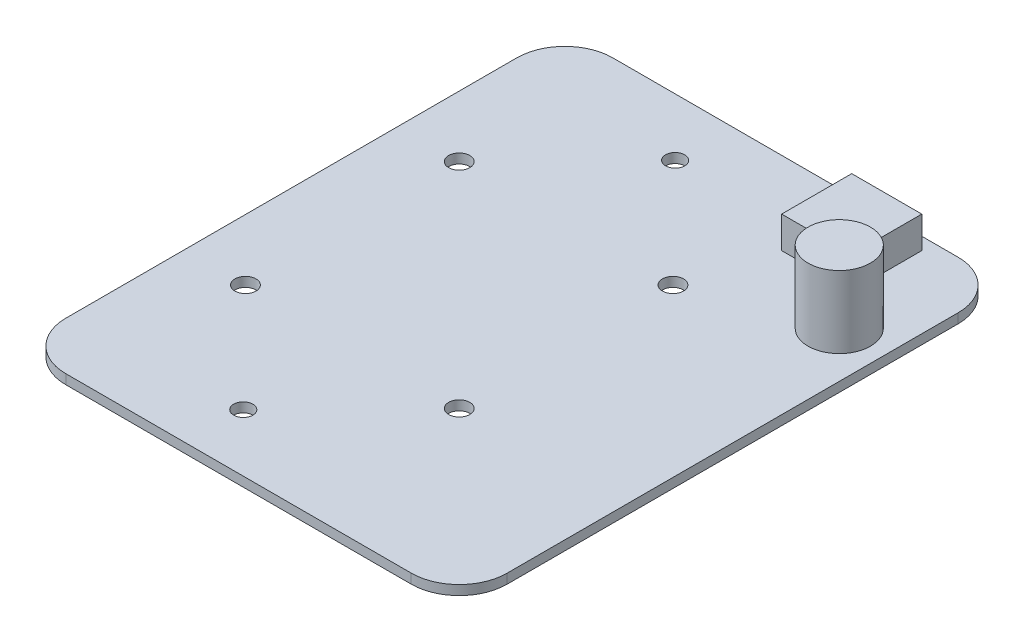
ISO-10303-21;
HEADER;
FILE_DESCRIPTION(('STEP AP214'),'2;1');
FILE_NAME('part.step','',(''),(''),'','','');
FILE_SCHEMA(('AUTOMOTIVE_DESIGN { 1 0 10303 214 1 1 1 1 }'));
ENDSEC;
DATA;
#1=APPLICATION_CONTEXT('core data for automotive mechanical design processes');
#2=APPLICATION_PROTOCOL_DEFINITION('international standard','automotive_design',2000,#1);
#3=PRODUCT_CONTEXT('',#1,'mechanical');
#4=PRODUCT('Part','Part','',(#3));
#5=PRODUCT_RELATED_PRODUCT_CATEGORY('part','',(#4));
#6=PRODUCT_DEFINITION_FORMATION('','',#4);
#7=PRODUCT_DEFINITION_CONTEXT('part definition',#1,'design');
#8=PRODUCT_DEFINITION('design','',#6,#7);
#9=PRODUCT_DEFINITION_SHAPE('','',#8);
#10=(LENGTH_UNIT() NAMED_UNIT(*) SI_UNIT(.MILLI.,.METRE.));
#11=(NAMED_UNIT(*) PLANE_ANGLE_UNIT() SI_UNIT($,.RADIAN.));
#12=(NAMED_UNIT(*) SI_UNIT($,.STERADIAN.) SOLID_ANGLE_UNIT());
#13=UNCERTAINTY_MEASURE_WITH_UNIT(LENGTH_MEASURE(1.E-05),#10,'distance_accuracy_value','');
#14=(GEOMETRIC_REPRESENTATION_CONTEXT(3) GLOBAL_UNCERTAINTY_ASSIGNED_CONTEXT((#13)) GLOBAL_UNIT_ASSIGNED_CONTEXT((#10,
#11,#12)) REPRESENTATION_CONTEXT('',''));
#15=CARTESIAN_POINT('',(0.,0.,0.));
#16=DIRECTION('',(0.,0.,1.));
#17=DIRECTION('',(1.,0.,0.));
#18=AXIS2_PLACEMENT_3D('',#15,#16,#17);
#19=CARTESIAN_POINT('',(-12.5,0.,-23.5));
#20=DIRECTION('',(0.,1.,0.));
#21=DIRECTION('',(0.,0.,1.));
#22=AXIS2_PLACEMENT_3D('',#19,#20,#21);
#23=PLANE('',#22);
#24=CARTESIAN_POINT('',(0.,0.,22.5));
#25=DIRECTION('',(0.,-1.,0.));
#26=DIRECTION('',(0.,0.,-1.));
#27=AXIS2_PLACEMENT_3D('',#24,#25,#26);
#28=CIRCLE('',#27,0.999999999999997);
#29=CARTESIAN_POINT('',(0.,0.,21.5));
#30=VERTEX_POINT('',#29);
#31=EDGE_CURVE('E175',#30,#30,#28,.T.);
#32=ORIENTED_EDGE('',*,*,#31,.F.);
#33=EDGE_LOOP('',(#32));
#34=FACE_BOUND('',#33,.T.);
#35=CARTESIAN_POINT('',(-11.136931804,3.11899811533678E-10,11.136931804));
#36=DIRECTION('',(0.,-1.,0.));
#37=DIRECTION('',(0.,0.,-1.));
#38=AXIS2_PLACEMENT_3D('',#35,#36,#37);
#39=CIRCLE('',#38,1.1);
#40=CARTESIAN_POINT('',(-11.136931804,3.11899811533678E-10,10.036931804));
#41=VERTEX_POINT('',#40);
#42=EDGE_CURVE('E191',#41,#41,#39,.T.);
#43=ORIENTED_EDGE('',*,*,#42,.F.);
#44=EDGE_LOOP('',(#43));
#45=FACE_BOUND('',#44,.T.);
#46=CARTESIAN_POINT('',(0.,0.,-22.5));
#47=DIRECTION('',(0.,-1.,0.));
#48=DIRECTION('',(0.,0.,-1.));
#49=AXIS2_PLACEMENT_3D('',#46,#47,#48);
#50=CIRCLE('',#49,1.);
#51=CARTESIAN_POINT('',(0.,0.,-23.5));
#52=VERTEX_POINT('',#51);
#53=EDGE_CURVE('E179',#52,#52,#50,.T.);
#54=ORIENTED_EDGE('',*,*,#53,.F.);
#55=EDGE_LOOP('',(#54));
#56=FACE_BOUND('',#55,.T.);
#57=CARTESIAN_POINT('',(11.136931804,3.11899811533678E-10,11.136931804));
#58=DIRECTION('',(0.,-1.,0.));
#59=DIRECTION('',(0.,0.,-1.));
#60=AXIS2_PLACEMENT_3D('',#57,#58,#59);
#61=CIRCLE('',#60,1.1);
#62=CARTESIAN_POINT('',(11.136931804,3.11899811533678E-10,10.036931804));
#63=VERTEX_POINT('',#62);
#64=EDGE_CURVE('E188',#63,#63,#61,.T.);
#65=ORIENTED_EDGE('',*,*,#64,.F.);
#66=EDGE_LOOP('',(#65));
#67=FACE_BOUND('',#66,.T.);
#68=CARTESIAN_POINT('',(11.136931804,-3.11899811533678E-10,-11.136931804));
#69=DIRECTION('',(0.,-1.,0.));
#70=DIRECTION('',(0.,0.,-1.));
#71=AXIS2_PLACEMENT_3D('',#68,#69,#70);
#72=CIRCLE('',#71,1.1);
#73=CARTESIAN_POINT('',(11.136931804,-3.11899811533678E-10,-12.236931804));
#74=VERTEX_POINT('',#73);
#75=EDGE_CURVE('E182',#74,#74,#72,.T.);
#76=ORIENTED_EDGE('',*,*,#75,.F.);
#77=EDGE_LOOP('',(#76));
#78=FACE_BOUND('',#77,.T.);
#79=CARTESIAN_POINT('',(-11.136931804,-3.11899811533678E-10,-11.136931804));
#80=DIRECTION('',(0.,-1.,0.));
#81=DIRECTION('',(0.,0.,-1.));
#82=AXIS2_PLACEMENT_3D('',#79,#80,#81);
#83=CIRCLE('',#82,1.1);
#84=CARTESIAN_POINT('',(-11.136931804,-3.11899811533678E-10,-12.236931804));
#85=VERTEX_POINT('',#84);
#86=EDGE_CURVE('E185',#85,#85,#83,.T.);
#87=ORIENTED_EDGE('',*,*,#86,.F.);
#88=EDGE_LOOP('',(#87));
#89=FACE_BOUND('',#88,.T.);
#90=CARTESIAN_POINT('',(-12.5,0.,23.5));
#91=DIRECTION('',(0.,-1.,0.));
#92=DIRECTION('',(0.,0.,-1.));
#93=AXIS2_PLACEMENT_3D('',#90,#91,#92);
#94=CIRCLE('',#93,5.);
#95=CARTESIAN_POINT('',(-17.5,0.,23.5));
#96=VERTEX_POINT('',#95);
#97=CARTESIAN_POINT('',(-12.5,0.,28.5));
#98=VERTEX_POINT('',#97);
#99=EDGE_CURVE('E106',#96,#98,#94,.F.);
#100=ORIENTED_EDGE('',*,*,#99,.F.);
#101=DIRECTION('',(0.,0.,-1.));
#102=VECTOR('',#101,1.);
#103=CARTESIAN_POINT('',(-17.5,0.,-23.5));
#104=LINE('',#103,#102);
#105=CARTESIAN_POINT('',(-17.5,0.,-23.5));
#106=VERTEX_POINT('',#105);
#107=EDGE_CURVE('E104',#106,#96,#104,.F.);
#108=ORIENTED_EDGE('',*,*,#107,.F.);
#109=CARTESIAN_POINT('',(-12.5,0.,-23.5));
#110=DIRECTION('',(0.,-1.,0.));
#111=DIRECTION('',(0.,0.,-1.));
#112=AXIS2_PLACEMENT_3D('',#109,#110,#111);
#113=CIRCLE('',#112,5.);
#114=CARTESIAN_POINT('',(-12.5,0.,-28.5));
#115=VERTEX_POINT('',#114);
#116=EDGE_CURVE('E19',#115,#106,#113,.F.);
#117=ORIENTED_EDGE('',*,*,#116,.F.);
#118=DIRECTION('',(1.,0.,0.));
#119=VECTOR('',#118,1.);
#120=CARTESIAN_POINT('',(0.,0.,-28.5));
#121=LINE('',#120,#119);
#122=CARTESIAN_POINT('',(23.5,0.,-28.5));
#123=VERTEX_POINT('',#122);
#124=EDGE_CURVE('E118',#123,#115,#121,.F.);
#125=ORIENTED_EDGE('',*,*,#124,.F.);
#126=CARTESIAN_POINT('',(23.5,0.,-23.5));
#127=DIRECTION('',(0.,-1.,0.));
#128=DIRECTION('',(0.,0.,-1.));
#129=AXIS2_PLACEMENT_3D('',#126,#127,#128);
#130=CIRCLE('',#129,5.);
#131=CARTESIAN_POINT('',(28.5,0.,-23.5));
#132=VERTEX_POINT('',#131);
#133=EDGE_CURVE('E195',#132,#123,#130,.F.);
#134=ORIENTED_EDGE('',*,*,#133,.F.);
#135=DIRECTION('',(0.,0.,1.));
#136=VECTOR('',#135,1.);
#137=CARTESIAN_POINT('',(28.5,0.,-23.5));
#138=LINE('',#137,#136);
#139=CARTESIAN_POINT('',(28.5,0.,23.5));
#140=VERTEX_POINT('',#139);
#141=EDGE_CURVE('E129',#140,#132,#138,.F.);
#142=ORIENTED_EDGE('',*,*,#141,.F.);
#143=CARTESIAN_POINT('',(23.5,0.,23.5));
#144=DIRECTION('',(0.,-1.,0.));
#145=DIRECTION('',(0.,0.,-1.));
#146=AXIS2_PLACEMENT_3D('',#143,#144,#145);
#147=CIRCLE('',#146,5.);
#148=CARTESIAN_POINT('',(23.5,0.,28.5));
#149=VERTEX_POINT('',#148);
#150=EDGE_CURVE('E199',#149,#140,#147,.F.);
#151=ORIENTED_EDGE('',*,*,#150,.F.);
#152=DIRECTION('',(-1.,0.,0.));
#153=VECTOR('',#152,1.);
#154=CARTESIAN_POINT('',(0.,0.,28.5));
#155=LINE('',#154,#153);
#156=EDGE_CURVE('E135',#98,#149,#155,.F.);
#157=ORIENTED_EDGE('',*,*,#156,.F.);
#158=EDGE_LOOP('',(#100,#108,#117,#125,#134,#142,#151,#157));
#159=FACE_BOUND('',#158,.T.);
#160=ADVANCED_FACE('F16',(#34,#45,#56,#67,#78,#89,#159),#23,.F.);
#161=CARTESIAN_POINT('',(0.,4.3,0.));
#162=DIRECTION('',(0.,1.,0.));
#163=DIRECTION('',(0.,0.,1.));
#164=AXIS2_PLACEMENT_3D('',#161,#162,#163);
#165=PLANE('',#164);
#166=DIRECTION('',(0.,0.,1.));
#167=VECTOR('',#166,1.);
#168=CARTESIAN_POINT('',(21.,4.3,-27.2));
#169=LINE('',#168,#167);
#170=CARTESIAN_POINT('',(21.,4.3,-27.2));
#171=VERTEX_POINT('',#170);
#172=CARTESIAN_POINT('',(21.,4.3,-19.9));
#173=VERTEX_POINT('',#172);
#174=EDGE_CURVE('E226',#171,#173,#169,.T.);
#175=ORIENTED_EDGE('',*,*,#174,.F.);
#176=DIRECTION('',(1.,0.,0.));
#177=VECTOR('',#176,1.);
#178=CARTESIAN_POINT('',(13.7,4.3,-27.2));
#179=LINE('',#178,#177);
#180=CARTESIAN_POINT('',(13.7,4.3,-27.2));
#181=VERTEX_POINT('',#180);
#182=EDGE_CURVE('E223',#181,#171,#179,.T.);
#183=ORIENTED_EDGE('',*,*,#182,.F.);
#184=DIRECTION('',(0.,0.,-1.));
#185=VECTOR('',#184,1.);
#186=CARTESIAN_POINT('',(13.7,4.3,-27.2));
#187=LINE('',#186,#185);
#188=CARTESIAN_POINT('',(13.7,4.3,-19.9));
#189=VERTEX_POINT('',#188);
#190=EDGE_CURVE('E218',#189,#181,#187,.T.);
#191=ORIENTED_EDGE('',*,*,#190,.F.);
#192=DIRECTION('',(-1.,0.,0.));
#193=VECTOR('',#192,1.);
#194=CARTESIAN_POINT('',(13.7,4.3,-19.9));
#195=LINE('',#194,#193);
#196=EDGE_CURVE('E178',#173,#189,#195,.T.);
#197=ORIENTED_EDGE('',*,*,#196,.F.);
#198=EDGE_LOOP('',(#175,#183,#191,#197));
#199=FACE_BOUND('',#198,.T.);
#200=ADVANCED_FACE('F453',(#199),#165,.T.);
#201=CARTESIAN_POINT('',(0.,1.,-28.5));
#202=DIRECTION('',(0.,0.,1.));
#203=DIRECTION('',(1.,0.,0.));
#204=AXIS2_PLACEMENT_3D('',#201,#202,#203);
#205=PLANE('',#204);
#206=DIRECTION('',(1.,0.,0.));
#207=VECTOR('',#206,1.);
#208=CARTESIAN_POINT('',(-12.5,1.,-28.5));
#209=LINE('',#208,#207);
#210=CARTESIAN_POINT('',(23.5,1.,-28.5));
#211=VERTEX_POINT('',#210);
#212=CARTESIAN_POINT('',(-12.5,1.,-28.5));
#213=VERTEX_POINT('',#212);
#214=EDGE_CURVE('E174',#211,#213,#209,.F.);
#215=ORIENTED_EDGE('',*,*,#214,.F.);
#216=DIRECTION('',(0.,1.,0.));
#217=VECTOR('',#216,1.);
#218=CARTESIAN_POINT('',(23.5,0.5,-28.5));
#219=LINE('',#218,#217);
#220=EDGE_CURVE('E198',#123,#211,#219,.T.);
#221=ORIENTED_EDGE('',*,*,#220,.F.);
#222=ORIENTED_EDGE('',*,*,#124,.T.);
#223=DIRECTION('',(0.,-1.,0.));
#224=VECTOR('',#223,1.);
#225=CARTESIAN_POINT('',(-12.5,0.5,-28.5));
#226=LINE('',#225,#224);
#227=EDGE_CURVE('E111',#213,#115,#226,.T.);
#228=ORIENTED_EDGE('',*,*,#227,.F.);
#229=EDGE_LOOP('',(#215,#221,#222,#228));
#230=FACE_BOUND('',#229,.T.);
#231=ADVANCED_FACE('F445',(#230),#205,.F.);
#232=CARTESIAN_POINT('',(-12.5,0.,-23.5));
#233=DIRECTION('',(0.,-1.,0.));
#234=DIRECTION('',(0.,0.,-1.));
#235=AXIS2_PLACEMENT_3D('',#232,#233,#234);
#236=CYLINDRICAL_SURFACE('',#235,5.);
#237=CARTESIAN_POINT('',(-12.5,1.,-23.5));
#238=DIRECTION('',(0.,-1.,0.));
#239=DIRECTION('',(0.,0.,-1.));
#240=AXIS2_PLACEMENT_3D('',#237,#238,#239);
#241=CIRCLE('',#240,5.);
#242=CARTESIAN_POINT('',(-17.5,1.,-23.5));
#243=VERTEX_POINT('',#242);
#244=EDGE_CURVE('E172',#213,#243,#241,.F.);
#245=ORIENTED_EDGE('',*,*,#244,.F.);
#246=ORIENTED_EDGE('',*,*,#227,.T.);
#247=ORIENTED_EDGE('',*,*,#116,.T.);
#248=DIRECTION('',(0.,1.,0.));
#249=VECTOR('',#248,1.);
#250=CARTESIAN_POINT('',(-17.5,1.,-23.5));
#251=LINE('',#250,#249);
#252=EDGE_CURVE('E110',#243,#106,#251,.F.);
#253=ORIENTED_EDGE('',*,*,#252,.F.);
#254=EDGE_LOOP('',(#245,#246,#247,#253));
#255=FACE_BOUND('',#254,.T.);
#256=ADVANCED_FACE('F116',(#255),#236,.T.);
#257=CARTESIAN_POINT('',(-17.5,1.,-23.5));
#258=DIRECTION('',(1.,0.,0.));
#259=DIRECTION('',(0.,0.,-1.));
#260=AXIS2_PLACEMENT_3D('',#257,#258,#259);
#261=PLANE('',#260);
#262=DIRECTION('',(0.,0.,1.));
#263=VECTOR('',#262,1.);
#264=CARTESIAN_POINT('',(-17.5,1.,-23.5));
#265=LINE('',#264,#263);
#266=CARTESIAN_POINT('',(-17.5,1.,23.5));
#267=VERTEX_POINT('',#266);
#268=EDGE_CURVE('E121',#243,#267,#265,.T.);
#269=ORIENTED_EDGE('',*,*,#268,.F.);
#270=ORIENTED_EDGE('',*,*,#252,.T.);
#271=ORIENTED_EDGE('',*,*,#107,.T.);
#272=DIRECTION('',(0.,-1.,0.));
#273=VECTOR('',#272,1.);
#274=CARTESIAN_POINT('',(-17.5,0.5,23.5));
#275=LINE('',#274,#273);
#276=EDGE_CURVE('E124',#267,#96,#275,.T.);
#277=ORIENTED_EDGE('',*,*,#276,.F.);
#278=EDGE_LOOP('',(#269,#270,#271,#277));
#279=FACE_BOUND('',#278,.T.);
#280=ADVANCED_FACE('F119',(#279),#261,.F.);
#281=CARTESIAN_POINT('',(-12.5,0.,23.5));
#282=DIRECTION('',(0.,-1.,0.));
#283=DIRECTION('',(0.,0.,-1.));
#284=AXIS2_PLACEMENT_3D('',#281,#282,#283);
#285=CYLINDRICAL_SURFACE('',#284,5.);
#286=CARTESIAN_POINT('',(-12.5,1.,23.5));
#287=DIRECTION('',(0.,-1.,0.));
#288=DIRECTION('',(0.,0.,-1.));
#289=AXIS2_PLACEMENT_3D('',#286,#287,#288);
#290=CIRCLE('',#289,5.);
#291=CARTESIAN_POINT('',(-12.5,1.,28.5));
#292=VERTEX_POINT('',#291);
#293=EDGE_CURVE('E169',#267,#292,#290,.F.);
#294=ORIENTED_EDGE('',*,*,#293,.F.);
#295=ORIENTED_EDGE('',*,*,#276,.T.);
#296=ORIENTED_EDGE('',*,*,#99,.T.);
#297=DIRECTION('',(0.,1.,0.));
#298=VECTOR('',#297,1.);
#299=CARTESIAN_POINT('',(-12.5,1.,28.5));
#300=LINE('',#299,#298);
#301=EDGE_CURVE('E137',#292,#98,#300,.F.);
#302=ORIENTED_EDGE('',*,*,#301,.F.);
#303=EDGE_LOOP('',(#294,#295,#296,#302));
#304=FACE_BOUND('',#303,.T.);
#305=ADVANCED_FACE('F422',(#304),#285,.T.);
#306=CARTESIAN_POINT('',(0.,1.,28.5));
#307=DIRECTION('',(0.,0.,-1.));
#308=DIRECTION('',(-1.,0.,0.));
#309=AXIS2_PLACEMENT_3D('',#306,#307,#308);
#310=PLANE('',#309);
#311=DIRECTION('',(1.,0.,0.));
#312=VECTOR('',#311,1.);
#313=CARTESIAN_POINT('',(-12.5,1.,28.5));
#314=LINE('',#313,#312);
#315=CARTESIAN_POINT('',(23.5,1.,28.5));
#316=VERTEX_POINT('',#315);
#317=EDGE_CURVE('E168',#292,#316,#314,.T.);
#318=ORIENTED_EDGE('',*,*,#317,.F.);
#319=ORIENTED_EDGE('',*,*,#301,.T.);
#320=ORIENTED_EDGE('',*,*,#156,.T.);
#321=DIRECTION('',(0.,-1.,0.));
#322=VECTOR('',#321,1.);
#323=CARTESIAN_POINT('',(23.5,0.5,28.5));
#324=LINE('',#323,#322);
#325=EDGE_CURVE('E133',#316,#149,#324,.T.);
#326=ORIENTED_EDGE('',*,*,#325,.F.);
#327=EDGE_LOOP('',(#318,#319,#320,#326));
#328=FACE_BOUND('',#327,.T.);
#329=ADVANCED_FACE('F414',(#328),#310,.F.);
#330=CARTESIAN_POINT('',(23.5,0.,23.5));
#331=DIRECTION('',(0.,-1.,0.));
#332=DIRECTION('',(0.,0.,-1.));
#333=AXIS2_PLACEMENT_3D('',#330,#331,#332);
#334=CYLINDRICAL_SURFACE('',#333,5.);
#335=CARTESIAN_POINT('',(23.5,1.,23.5));
#336=DIRECTION('',(0.,-1.,0.));
#337=DIRECTION('',(0.,0.,-1.));
#338=AXIS2_PLACEMENT_3D('',#335,#336,#337);
#339=CIRCLE('',#338,5.);
#340=CARTESIAN_POINT('',(28.5,1.,23.5));
#341=VERTEX_POINT('',#340);
#342=EDGE_CURVE('E165',#316,#341,#339,.F.);
#343=ORIENTED_EDGE('',*,*,#342,.F.);
#344=ORIENTED_EDGE('',*,*,#325,.T.);
#345=ORIENTED_EDGE('',*,*,#150,.T.);
#346=DIRECTION('',(0.,1.,0.));
#347=VECTOR('',#346,1.);
#348=CARTESIAN_POINT('',(28.5,1.,23.5));
#349=LINE('',#348,#347);
#350=EDGE_CURVE('E132',#341,#140,#349,.F.);
#351=ORIENTED_EDGE('',*,*,#350,.F.);
#352=EDGE_LOOP('',(#343,#344,#345,#351));
#353=FACE_BOUND('',#352,.T.);
#354=ADVANCED_FACE('F405',(#353),#334,.T.);
#355=CARTESIAN_POINT('',(28.5,1.,-23.5));
#356=DIRECTION('',(-1.,0.,0.));
#357=DIRECTION('',(0.,0.,1.));
#358=AXIS2_PLACEMENT_3D('',#355,#356,#357);
#359=PLANE('',#358);
#360=DIRECTION('',(0.,0.,1.));
#361=VECTOR('',#360,1.);
#362=CARTESIAN_POINT('',(28.5,1.,-23.5));
#363=LINE('',#362,#361);
#364=CARTESIAN_POINT('',(28.5,1.,-23.5));
#365=VERTEX_POINT('',#364);
#366=EDGE_CURVE('E164',#341,#365,#363,.F.);
#367=ORIENTED_EDGE('',*,*,#366,.F.);
#368=ORIENTED_EDGE('',*,*,#350,.T.);
#369=ORIENTED_EDGE('',*,*,#141,.T.);
#370=DIRECTION('',(0.,-1.,0.));
#371=VECTOR('',#370,1.);
#372=CARTESIAN_POINT('',(28.5,0.5,-23.5));
#373=LINE('',#372,#371);
#374=EDGE_CURVE('E194',#365,#132,#373,.T.);
#375=ORIENTED_EDGE('',*,*,#374,.F.);
#376=EDGE_LOOP('',(#367,#368,#369,#375));
#377=FACE_BOUND('',#376,.T.);
#378=ADVANCED_FACE('F396',(#377),#359,.F.);
#379=CARTESIAN_POINT('',(23.5,0.,-23.5));
#380=DIRECTION('',(0.,-1.,0.));
#381=DIRECTION('',(0.,0.,-1.));
#382=AXIS2_PLACEMENT_3D('',#379,#380,#381);
#383=CYLINDRICAL_SURFACE('',#382,5.);
#384=CARTESIAN_POINT('',(23.5,1.,-23.5));
#385=DIRECTION('',(0.,-1.,0.));
#386=DIRECTION('',(0.,0.,-1.));
#387=AXIS2_PLACEMENT_3D('',#384,#385,#386);
#388=CIRCLE('',#387,5.);
#389=EDGE_CURVE('E161',#365,#211,#388,.F.);
#390=ORIENTED_EDGE('',*,*,#389,.F.);
#391=ORIENTED_EDGE('',*,*,#374,.T.);
#392=ORIENTED_EDGE('',*,*,#133,.T.);
#393=ORIENTED_EDGE('',*,*,#220,.T.);
#394=EDGE_LOOP('',(#390,#391,#392,#393));
#395=FACE_BOUND('',#394,.T.);
#396=ADVANCED_FACE('F387',(#395),#383,.T.);
#397=CARTESIAN_POINT('',(-11.136931804,1.,11.136931804));
#398=DIRECTION('',(0.,-1.,0.));
#399=DIRECTION('',(0.,0.,-1.));
#400=AXIS2_PLACEMENT_3D('',#397,#398,#399);
#401=CYLINDRICAL_SURFACE('',#400,1.1);
#402=CARTESIAN_POINT('',(-11.136931804,1.0000000003119,11.136931804));
#403=DIRECTION('',(0.,-1.,0.));
#404=DIRECTION('',(0.,0.,-1.));
#405=AXIS2_PLACEMENT_3D('',#402,#403,#404);
#406=CIRCLE('',#405,1.1);
#407=CARTESIAN_POINT('',(-11.136931804,1.0000000003119,10.036931804));
#408=VERTEX_POINT('',#407);
#409=EDGE_CURVE('E158',#408,#408,#406,.T.);
#410=ORIENTED_EDGE('',*,*,#409,.F.);
#411=EDGE_LOOP('',(#410));
#412=FACE_BOUND('',#411,.T.);
#413=ORIENTED_EDGE('',*,*,#42,.T.);
#414=EDGE_LOOP('',(#413));
#415=FACE_BOUND('',#414,.T.);
#416=ADVANCED_FACE('F378',(#412,#415),#401,.F.);
#417=CARTESIAN_POINT('',(11.136931804,1.,11.136931804));
#418=DIRECTION('',(0.,-1.,0.));
#419=DIRECTION('',(0.,0.,-1.));
#420=AXIS2_PLACEMENT_3D('',#417,#418,#419);
#421=CYLINDRICAL_SURFACE('',#420,1.1);
#422=CARTESIAN_POINT('',(11.136931804,1.0000000003119,11.136931804));
#423=DIRECTION('',(0.,-1.,0.));
#424=DIRECTION('',(0.,0.,-1.));
#425=AXIS2_PLACEMENT_3D('',#422,#423,#424);
#426=CIRCLE('',#425,1.1);
#427=CARTESIAN_POINT('',(11.136931804,1.0000000003119,10.036931804));
#428=VERTEX_POINT('',#427);
#429=EDGE_CURVE('E155',#428,#428,#426,.T.);
#430=ORIENTED_EDGE('',*,*,#429,.F.);
#431=EDGE_LOOP('',(#430));
#432=FACE_BOUND('',#431,.T.);
#433=ORIENTED_EDGE('',*,*,#64,.T.);
#434=EDGE_LOOP('',(#433));
#435=FACE_BOUND('',#434,.T.);
#436=ADVANCED_FACE('F369',(#432,#435),#421,.F.);
#437=CARTESIAN_POINT('',(-11.136931804,1.,-11.136931804));
#438=DIRECTION('',(0.,-1.,0.));
#439=DIRECTION('',(0.,0.,-1.));
#440=AXIS2_PLACEMENT_3D('',#437,#438,#439);
#441=CYLINDRICAL_SURFACE('',#440,1.1);
#442=CARTESIAN_POINT('',(-11.136931804,0.9999999996881,-11.136931804));
#443=DIRECTION('',(0.,-1.,0.));
#444=DIRECTION('',(0.,0.,-1.));
#445=AXIS2_PLACEMENT_3D('',#442,#443,#444);
#446=CIRCLE('',#445,1.1);
#447=CARTESIAN_POINT('',(-11.136931804,0.9999999996881,-12.236931804));
#448=VERTEX_POINT('',#447);
#449=EDGE_CURVE('E152',#448,#448,#446,.T.);
#450=ORIENTED_EDGE('',*,*,#449,.F.);
#451=EDGE_LOOP('',(#450));
#452=FACE_BOUND('',#451,.T.);
#453=ORIENTED_EDGE('',*,*,#86,.T.);
#454=EDGE_LOOP('',(#453));
#455=FACE_BOUND('',#454,.T.);
#456=ADVANCED_FACE('F360',(#452,#455),#441,.F.);
#457=CARTESIAN_POINT('',(11.136931804,1.,-11.136931804));
#458=DIRECTION('',(0.,-1.,0.));
#459=DIRECTION('',(0.,0.,-1.));
#460=AXIS2_PLACEMENT_3D('',#457,#458,#459);
#461=CYLINDRICAL_SURFACE('',#460,1.1);
#462=CARTESIAN_POINT('',(11.136931804,0.9999999996881,-11.136931804));
#463=DIRECTION('',(0.,-1.,0.));
#464=DIRECTION('',(0.,0.,-1.));
#465=AXIS2_PLACEMENT_3D('',#462,#463,#464);
#466=CIRCLE('',#465,1.1);
#467=CARTESIAN_POINT('',(11.136931804,0.9999999996881,-12.236931804));
#468=VERTEX_POINT('',#467);
#469=EDGE_CURVE('E149',#468,#468,#466,.T.);
#470=ORIENTED_EDGE('',*,*,#469,.F.);
#471=EDGE_LOOP('',(#470));
#472=FACE_BOUND('',#471,.T.);
#473=ORIENTED_EDGE('',*,*,#75,.T.);
#474=EDGE_LOOP('',(#473));
#475=FACE_BOUND('',#474,.T.);
#476=ADVANCED_FACE('F351',(#472,#475),#461,.F.);
#477=CARTESIAN_POINT('',(0.,1.,-22.5));
#478=DIRECTION('',(0.,-1.,0.));
#479=DIRECTION('',(0.,0.,-1.));
#480=AXIS2_PLACEMENT_3D('',#477,#478,#479);
#481=CYLINDRICAL_SURFACE('',#480,1.);
#482=CARTESIAN_POINT('',(0.,1.,-22.5));
#483=DIRECTION('',(0.,-1.,0.));
#484=DIRECTION('',(0.,0.,-1.));
#485=AXIS2_PLACEMENT_3D('',#482,#483,#484);
#486=CIRCLE('',#485,1.);
#487=CARTESIAN_POINT('',(0.,1.,-23.5));
#488=VERTEX_POINT('',#487);
#489=EDGE_CURVE('E146',#488,#488,#486,.T.);
#490=ORIENTED_EDGE('',*,*,#489,.F.);
#491=EDGE_LOOP('',(#490));
#492=FACE_BOUND('',#491,.T.);
#493=ORIENTED_EDGE('',*,*,#53,.T.);
#494=EDGE_LOOP('',(#493));
#495=FACE_BOUND('',#494,.T.);
#496=ADVANCED_FACE('F342',(#492,#495),#481,.F.);
#497=CARTESIAN_POINT('',(0.,1.,22.5));
#498=DIRECTION('',(0.,-1.,0.));
#499=DIRECTION('',(0.,0.,-1.));
#500=AXIS2_PLACEMENT_3D('',#497,#498,#499);
#501=CYLINDRICAL_SURFACE('',#500,0.999999999999997);
#502=CARTESIAN_POINT('',(0.,1.,22.5));
#503=DIRECTION('',(0.,-1.,0.));
#504=DIRECTION('',(0.,0.,-1.));
#505=AXIS2_PLACEMENT_3D('',#502,#503,#504);
#506=CIRCLE('',#505,0.999999999999997);
#507=CARTESIAN_POINT('',(0.,1.,21.5));
#508=VERTEX_POINT('',#507);
#509=EDGE_CURVE('E142',#508,#508,#506,.T.);
#510=ORIENTED_EDGE('',*,*,#509,.F.);
#511=EDGE_LOOP('',(#510));
#512=FACE_BOUND('',#511,.T.);
#513=ORIENTED_EDGE('',*,*,#31,.T.);
#514=EDGE_LOOP('',(#513));
#515=FACE_BOUND('',#514,.T.);
#516=ADVANCED_FACE('F334',(#512,#515),#501,.F.);
#517=CARTESIAN_POINT('',(13.7,4.3,-19.9));
#518=DIRECTION('',(0.,0.,-1.));
#519=DIRECTION('',(-1.,0.,0.));
#520=AXIS2_PLACEMENT_3D('',#517,#518,#519);
#521=PLANE('',#520);
#522=ORIENTED_EDGE('',*,*,#196,.T.);
#523=DIRECTION('',(0.,1.,0.));
#524=VECTOR('',#523,1.);
#525=CARTESIAN_POINT('',(13.7,4.3,-19.9));
#526=LINE('',#525,#524);
#527=CARTESIAN_POINT('',(13.7,1.,-19.9));
#528=VERTEX_POINT('',#527);
#529=EDGE_CURVE('E215',#528,#189,#526,.T.);
#530=ORIENTED_EDGE('',*,*,#529,.F.);
#531=DIRECTION('',(1.,0.,0.));
#532=VECTOR('',#531,1.);
#533=CARTESIAN_POINT('',(-12.5,1.,-19.9));
#534=LINE('',#533,#532);
#535=CARTESIAN_POINT('',(21.,1.,-19.9));
#536=VERTEX_POINT('',#535);
#537=EDGE_CURVE('E145',#536,#528,#534,.F.);
#538=ORIENTED_EDGE('',*,*,#537,.F.);
#539=DIRECTION('',(0.,1.,0.));
#540=VECTOR('',#539,1.);
#541=CARTESIAN_POINT('',(21.,4.3,-19.9));
#542=LINE('',#541,#540);
#543=EDGE_CURVE('E229',#173,#536,#542,.F.);
#544=ORIENTED_EDGE('',*,*,#543,.F.);
#545=EDGE_LOOP('',(#522,#530,#538,#544));
#546=FACE_BOUND('',#545,.T.);
#547=ADVANCED_FACE('F256',(#546),#521,.F.);
#548=CARTESIAN_POINT('',(13.7,4.3,-27.2));
#549=DIRECTION('',(1.,0.,0.));
#550=DIRECTION('',(0.,0.,-1.));
#551=AXIS2_PLACEMENT_3D('',#548,#549,#550);
#552=PLANE('',#551);
#553=ORIENTED_EDGE('',*,*,#190,.T.);
#554=DIRECTION('',(0.,1.,0.));
#555=VECTOR('',#554,1.);
#556=CARTESIAN_POINT('',(13.7,4.3,-27.2));
#557=LINE('',#556,#555);
#558=CARTESIAN_POINT('',(13.7,1.,-27.2));
#559=VERTEX_POINT('',#558);
#560=EDGE_CURVE('E220',#559,#181,#557,.T.);
#561=ORIENTED_EDGE('',*,*,#560,.F.);
#562=DIRECTION('',(0.,0.,1.));
#563=VECTOR('',#562,1.);
#564=CARTESIAN_POINT('',(13.7,1.,-23.5));
#565=LINE('',#564,#563);
#566=EDGE_CURVE('E241',#528,#559,#565,.F.);
#567=ORIENTED_EDGE('',*,*,#566,.F.);
#568=ORIENTED_EDGE('',*,*,#529,.T.);
#569=EDGE_LOOP('',(#553,#561,#567,#568));
#570=FACE_BOUND('',#569,.T.);
#571=ADVANCED_FACE('F260',(#570),#552,.F.);
#572=CARTESIAN_POINT('',(13.7,4.3,-27.2));
#573=DIRECTION('',(0.,0.,1.));
#574=DIRECTION('',(1.,0.,0.));
#575=AXIS2_PLACEMENT_3D('',#572,#573,#574);
#576=PLANE('',#575);
#577=ORIENTED_EDGE('',*,*,#182,.T.);
#578=DIRECTION('',(0.,1.,0.));
#579=VECTOR('',#578,1.);
#580=CARTESIAN_POINT('',(21.,4.3,-27.2));
#581=LINE('',#580,#579);
#582=CARTESIAN_POINT('',(21.,1.,-27.2));
#583=VERTEX_POINT('',#582);
#584=EDGE_CURVE('E34',#583,#171,#581,.T.);
#585=ORIENTED_EDGE('',*,*,#584,.F.);
#586=DIRECTION('',(1.,0.,0.));
#587=VECTOR('',#586,1.);
#588=CARTESIAN_POINT('',(-12.5,1.,-27.2));
#589=LINE('',#588,#587);
#590=EDGE_CURVE('E244',#559,#583,#589,.T.);
#591=ORIENTED_EDGE('',*,*,#590,.F.);
#592=ORIENTED_EDGE('',*,*,#560,.T.);
#593=EDGE_LOOP('',(#577,#585,#591,#592));
#594=FACE_BOUND('',#593,.T.);
#595=ADVANCED_FACE('F262',(#594),#576,.F.);
#596=CARTESIAN_POINT('',(21.,4.3,-27.2));
#597=DIRECTION('',(-1.,0.,0.));
#598=DIRECTION('',(0.,0.,1.));
#599=AXIS2_PLACEMENT_3D('',#596,#597,#598);
#600=PLANE('',#599);
#601=ORIENTED_EDGE('',*,*,#174,.T.);
#602=ORIENTED_EDGE('',*,*,#543,.T.);
#603=DIRECTION('',(0.,0.,1.));
#604=VECTOR('',#603,1.);
#605=CARTESIAN_POINT('',(21.,1.,-23.5));
#606=LINE('',#605,#604);
#607=EDGE_CURVE('E141',#583,#536,#606,.T.);
#608=ORIENTED_EDGE('',*,*,#607,.F.);
#609=ORIENTED_EDGE('',*,*,#584,.T.);
#610=EDGE_LOOP('',(#601,#602,#608,#609));
#611=FACE_BOUND('',#610,.T.);
#612=ADVANCED_FACE('F252',(#611),#600,.F.);
#613=CARTESIAN_POINT('',(23.7,8.5,-15.9));
#614=DIRECTION('',(0.,1.,0.));
#615=DIRECTION('',(0.,0.,1.));
#616=AXIS2_PLACEMENT_3D('',#613,#614,#615);
#617=PLANE('',#616);
#618=CARTESIAN_POINT('',(23.7,8.5,-15.9));
#619=DIRECTION('',(0.,-1.,0.));
#620=DIRECTION('',(0.,0.,-1.));
#621=AXIS2_PLACEMENT_3D('',#618,#619,#620);
#622=CIRCLE('',#621,3.25);
#623=CARTESIAN_POINT('',(23.7,8.5,-19.15));
#624=VERTEX_POINT('',#623);
#625=EDGE_CURVE('E25',#624,#624,#622,.T.);
#626=ORIENTED_EDGE('',*,*,#625,.F.);
#627=EDGE_LOOP('',(#626));
#628=FACE_BOUND('',#627,.T.);
#629=ADVANCED_FACE('F270',(#628),#617,.T.);
#630=CARTESIAN_POINT('',(-12.5,1.,-23.5));
#631=DIRECTION('',(0.,1.,0.));
#632=DIRECTION('',(0.,0.,1.));
#633=AXIS2_PLACEMENT_3D('',#630,#631,#632);
#634=PLANE('',#633);
#635=ORIENTED_EDGE('',*,*,#590,.T.);
#636=ORIENTED_EDGE('',*,*,#607,.T.);
#637=ORIENTED_EDGE('',*,*,#537,.T.);
#638=ORIENTED_EDGE('',*,*,#566,.T.);
#639=EDGE_LOOP('',(#635,#636,#637,#638));
#640=FACE_BOUND('',#639,.T.);
#641=ORIENTED_EDGE('',*,*,#509,.T.);
#642=EDGE_LOOP('',(#641));
#643=FACE_BOUND('',#642,.T.);
#644=ORIENTED_EDGE('',*,*,#489,.T.);
#645=EDGE_LOOP('',(#644));
#646=FACE_BOUND('',#645,.T.);
#647=ORIENTED_EDGE('',*,*,#469,.T.);
#648=EDGE_LOOP('',(#647));
#649=FACE_BOUND('',#648,.T.);
#650=ORIENTED_EDGE('',*,*,#449,.T.);
#651=EDGE_LOOP('',(#650));
#652=FACE_BOUND('',#651,.T.);
#653=ORIENTED_EDGE('',*,*,#429,.T.);
#654=EDGE_LOOP('',(#653));
#655=FACE_BOUND('',#654,.T.);
#656=ORIENTED_EDGE('',*,*,#409,.T.);
#657=EDGE_LOOP('',(#656));
#658=FACE_BOUND('',#657,.T.);
#659=CARTESIAN_POINT('',(23.7,1.,-15.9));
#660=DIRECTION('',(0.,-1.,0.));
#661=DIRECTION('',(0.,0.,-1.));
#662=AXIS2_PLACEMENT_3D('',#659,#660,#661);
#663=CIRCLE('',#662,3.25);
#664=CARTESIAN_POINT('',(23.7,1.,-19.15));
#665=VERTEX_POINT('',#664);
#666=EDGE_CURVE('E11',#665,#665,#663,.F.);
#667=ORIENTED_EDGE('',*,*,#666,.F.);
#668=EDGE_LOOP('',(#667));
#669=FACE_BOUND('',#668,.T.);
#670=ORIENTED_EDGE('',*,*,#366,.T.);
#671=ORIENTED_EDGE('',*,*,#389,.T.);
#672=ORIENTED_EDGE('',*,*,#214,.T.);
#673=ORIENTED_EDGE('',*,*,#244,.T.);
#674=ORIENTED_EDGE('',*,*,#268,.T.);
#675=ORIENTED_EDGE('',*,*,#293,.T.);
#676=ORIENTED_EDGE('',*,*,#317,.T.);
#677=ORIENTED_EDGE('',*,*,#342,.T.);
#678=EDGE_LOOP('',(#670,#671,#672,#673,#674,#675,#676,#677));
#679=FACE_BOUND('',#678,.T.);
#680=ADVANCED_FACE('F249',(#640,#643,#646,#649,#652,#655,#658,#669,#679),#634,.T.);
#681=CARTESIAN_POINT('',(23.7,1.,-15.9));
#682=DIRECTION('',(0.,-1.,0.));
#683=DIRECTION('',(0.,0.,-1.));
#684=AXIS2_PLACEMENT_3D('',#681,#682,#683);
#685=CYLINDRICAL_SURFACE('',#684,3.25);
#686=ORIENTED_EDGE('',*,*,#666,.T.);
#687=EDGE_LOOP('',(#686));
#688=FACE_BOUND('',#687,.T.);
#689=ORIENTED_EDGE('',*,*,#625,.T.);
#690=EDGE_LOOP('',(#689));
#691=FACE_BOUND('',#690,.T.);
#692=ADVANCED_FACE('F273',(#688,#691),#685,.T.);
#693=CLOSED_SHELL('',(#160,#200,#231,#256,#280,#305,#329,#354,#378,#396,#416,#436,#456,#476,
#496,#516,#547,#571,#595,#612,#629,#680,#692));
#694=MANIFOLD_SOLID_BREP('B1',#693);
#695=ADVANCED_BREP_SHAPE_REPRESENTATION('',(#18,#694),#14);
#696=SHAPE_DEFINITION_REPRESENTATION(#9,#695);
ENDSEC;
END-ISO-10303-21;
